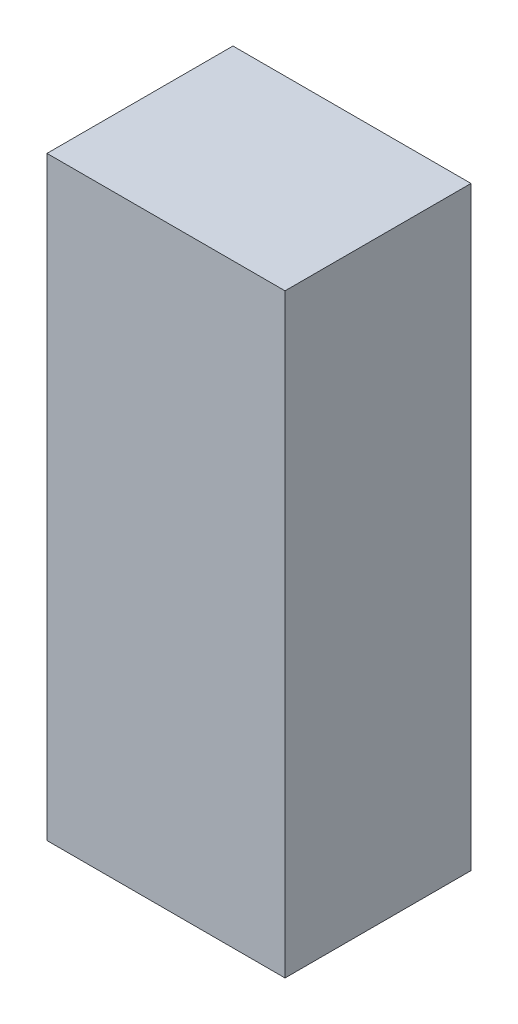
ISO-10303-21;
HEADER;
FILE_DESCRIPTION(('STEP AP214'),'2;1');
FILE_NAME('part.step','',(''),(''),'','','');
FILE_SCHEMA(('AUTOMOTIVE_DESIGN { 1 0 10303 214 1 1 1 1 }'));
ENDSEC;
DATA;
#1=APPLICATION_CONTEXT('core data for automotive mechanical design processes');
#2=APPLICATION_PROTOCOL_DEFINITION('international standard','automotive_design',2000,#1);
#3=PRODUCT_CONTEXT('',#1,'mechanical');
#4=PRODUCT('Part','Part','',(#3));
#5=PRODUCT_RELATED_PRODUCT_CATEGORY('part','',(#4));
#6=PRODUCT_DEFINITION_FORMATION('','',#4);
#7=PRODUCT_DEFINITION_CONTEXT('part definition',#1,'design');
#8=PRODUCT_DEFINITION('design','',#6,#7);
#9=PRODUCT_DEFINITION_SHAPE('','',#8);
#10=(LENGTH_UNIT() NAMED_UNIT(*) SI_UNIT(.MILLI.,.METRE.));
#11=(NAMED_UNIT(*) PLANE_ANGLE_UNIT() SI_UNIT($,.RADIAN.));
#12=(NAMED_UNIT(*) SI_UNIT($,.STERADIAN.) SOLID_ANGLE_UNIT());
#13=UNCERTAINTY_MEASURE_WITH_UNIT(LENGTH_MEASURE(1.E-05),#10,'distance_accuracy_value','');
#14=(GEOMETRIC_REPRESENTATION_CONTEXT(3) GLOBAL_UNCERTAINTY_ASSIGNED_CONTEXT((#13)) GLOBAL_UNIT_ASSIGNED_CONTEXT((#10,
#11,#12)) REPRESENTATION_CONTEXT('',''));
#15=CARTESIAN_POINT('',(0.,0.,0.));
#16=DIRECTION('',(0.,0.,1.));
#17=DIRECTION('',(1.,0.,0.));
#18=AXIS2_PLACEMENT_3D('',#15,#16,#17);
#19=CARTESIAN_POINT('',(-16.,40.,25.));
#20=DIRECTION('',(1.,0.,0.));
#21=DIRECTION('',(0.,0.,-1.));
#22=AXIS2_PLACEMENT_3D('',#19,#20,#21);
#23=PLANE('',#22);
#24=DIRECTION('',(0.,-1.,0.));
#25=VECTOR('',#24,1.);
#26=CARTESIAN_POINT('',(-16.,40.,0.));
#27=LINE('',#26,#25);
#28=CARTESIAN_POINT('',(-16.,40.,0.));
#29=VERTEX_POINT('',#28);
#30=CARTESIAN_POINT('',(-16.,-40.,0.));
#31=VERTEX_POINT('',#30);
#32=EDGE_CURVE('E107',#29,#31,#27,.T.);
#33=ORIENTED_EDGE('',*,*,#32,.T.);
#34=DIRECTION('',(0.,0.,-1.));
#35=VECTOR('',#34,1.);
#36=CARTESIAN_POINT('',(-16.,-40.,25.));
#37=LINE('',#36,#35);
#38=CARTESIAN_POINT('',(-16.,-40.,25.));
#39=VERTEX_POINT('',#38);
#40=EDGE_CURVE('E11',#39,#31,#37,.T.);
#41=ORIENTED_EDGE('',*,*,#40,.F.);
#42=DIRECTION('',(0.,-1.,0.));
#43=VECTOR('',#42,1.);
#44=CARTESIAN_POINT('',(-16.,40.,25.));
#45=LINE('',#44,#43);
#46=CARTESIAN_POINT('',(-16.,40.,25.));
#47=VERTEX_POINT('',#46);
#48=EDGE_CURVE('E91',#47,#39,#45,.T.);
#49=ORIENTED_EDGE('',*,*,#48,.F.);
#50=DIRECTION('',(0.,0.,-1.));
#51=VECTOR('',#50,1.);
#52=CARTESIAN_POINT('',(-16.,40.,25.));
#53=LINE('',#52,#51);
#54=EDGE_CURVE('E103',#47,#29,#53,.T.);
#55=ORIENTED_EDGE('',*,*,#54,.T.);
#56=EDGE_LOOP('',(#33,#41,#49,#55));
#57=FACE_BOUND('',#56,.T.);
#58=ADVANCED_FACE('F39',(#57),#23,.F.);
#59=CARTESIAN_POINT('',(-16.,-40.,25.));
#60=DIRECTION('',(0.,1.,0.));
#61=DIRECTION('',(-1.,0.,0.));
#62=AXIS2_PLACEMENT_3D('',#59,#60,#61);
#63=PLANE('',#62);
#64=DIRECTION('',(1.,0.,0.));
#65=VECTOR('',#64,1.);
#66=CARTESIAN_POINT('',(-16.,-40.,0.));
#67=LINE('',#66,#65);
#68=CARTESIAN_POINT('',(16.,-40.,0.));
#69=VERTEX_POINT('',#68);
#70=EDGE_CURVE('E96',#31,#69,#67,.T.);
#71=ORIENTED_EDGE('',*,*,#70,.T.);
#72=DIRECTION('',(0.,0.,-1.));
#73=VECTOR('',#72,1.);
#74=CARTESIAN_POINT('',(16.,-40.,25.));
#75=LINE('',#74,#73);
#76=CARTESIAN_POINT('',(16.,-40.,25.));
#77=VERTEX_POINT('',#76);
#78=EDGE_CURVE('E48',#77,#69,#75,.T.);
#79=ORIENTED_EDGE('',*,*,#78,.F.);
#80=DIRECTION('',(1.,0.,0.));
#81=VECTOR('',#80,1.);
#82=CARTESIAN_POINT('',(-16.,-40.,25.));
#83=LINE('',#82,#81);
#84=EDGE_CURVE('E86',#39,#77,#83,.T.);
#85=ORIENTED_EDGE('',*,*,#84,.F.);
#86=ORIENTED_EDGE('',*,*,#40,.T.);
#87=EDGE_LOOP('',(#71,#79,#85,#86));
#88=FACE_BOUND('',#87,.T.);
#89=ADVANCED_FACE('F95',(#88),#63,.F.);
#90=CARTESIAN_POINT('',(16.,40.,25.));
#91=DIRECTION('',(-1.,0.,0.));
#92=DIRECTION('',(0.,-1.,0.));
#93=AXIS2_PLACEMENT_3D('',#90,#91,#92);
#94=PLANE('',#93);
#95=DIRECTION('',(0.,1.,0.));
#96=VECTOR('',#95,1.);
#97=CARTESIAN_POINT('',(16.,40.,0.));
#98=LINE('',#97,#96);
#99=CARTESIAN_POINT('',(16.,40.,0.));
#100=VERTEX_POINT('',#99);
#101=EDGE_CURVE('E73',#69,#100,#98,.T.);
#102=ORIENTED_EDGE('',*,*,#101,.T.);
#103=DIRECTION('',(0.,0.,-1.));
#104=VECTOR('',#103,1.);
#105=CARTESIAN_POINT('',(16.,40.,25.));
#106=LINE('',#105,#104);
#107=CARTESIAN_POINT('',(16.,40.,25.));
#108=VERTEX_POINT('',#107);
#109=EDGE_CURVE('E98',#108,#100,#106,.T.);
#110=ORIENTED_EDGE('',*,*,#109,.F.);
#111=DIRECTION('',(0.,1.,0.));
#112=VECTOR('',#111,1.);
#113=CARTESIAN_POINT('',(16.,40.,25.));
#114=LINE('',#113,#112);
#115=EDGE_CURVE('E89',#77,#108,#114,.T.);
#116=ORIENTED_EDGE('',*,*,#115,.F.);
#117=ORIENTED_EDGE('',*,*,#78,.T.);
#118=EDGE_LOOP('',(#102,#110,#116,#117));
#119=FACE_BOUND('',#118,.T.);
#120=ADVANCED_FACE('F99',(#119),#94,.F.);
#121=CARTESIAN_POINT('',(-16.,40.,25.));
#122=DIRECTION('',(0.,-1.,0.));
#123=DIRECTION('',(1.,0.,0.));
#124=AXIS2_PLACEMENT_3D('',#121,#122,#123);
#125=PLANE('',#124);
#126=DIRECTION('',(-1.,0.,0.));
#127=VECTOR('',#126,1.);
#128=CARTESIAN_POINT('',(-16.,40.,0.));
#129=LINE('',#128,#127);
#130=EDGE_CURVE('E79',#100,#29,#129,.T.);
#131=ORIENTED_EDGE('',*,*,#130,.T.);
#132=ORIENTED_EDGE('',*,*,#54,.F.);
#133=DIRECTION('',(-1.,0.,0.));
#134=VECTOR('',#133,1.);
#135=CARTESIAN_POINT('',(-16.,40.,25.));
#136=LINE('',#135,#134);
#137=EDGE_CURVE('E56',#108,#47,#136,.T.);
#138=ORIENTED_EDGE('',*,*,#137,.F.);
#139=ORIENTED_EDGE('',*,*,#109,.T.);
#140=EDGE_LOOP('',(#131,#132,#138,#139));
#141=FACE_BOUND('',#140,.T.);
#142=ADVANCED_FACE('F120',(#141),#125,.F.);
#143=CARTESIAN_POINT('',(0.,0.,25.));
#144=DIRECTION('',(0.,0.,1.));
#145=DIRECTION('',(1.,0.,0.));
#146=AXIS2_PLACEMENT_3D('',#143,#144,#145);
#147=PLANE('',#146);
#148=ORIENTED_EDGE('',*,*,#48,.T.);
#149=ORIENTED_EDGE('',*,*,#84,.T.);
#150=ORIENTED_EDGE('',*,*,#115,.T.);
#151=ORIENTED_EDGE('',*,*,#137,.T.);
#152=EDGE_LOOP('',(#148,#149,#150,#151));
#153=FACE_BOUND('',#152,.T.);
#154=ADVANCED_FACE('F87',(#153),#147,.T.);
#155=CARTESIAN_POINT('',(0.,0.,0.));
#156=DIRECTION('',(0.,0.,1.));
#157=DIRECTION('',(1.,0.,0.));
#158=AXIS2_PLACEMENT_3D('',#155,#156,#157);
#159=PLANE('',#158);
#160=ORIENTED_EDGE('',*,*,#32,.F.);
#161=ORIENTED_EDGE('',*,*,#130,.F.);
#162=ORIENTED_EDGE('',*,*,#101,.F.);
#163=ORIENTED_EDGE('',*,*,#70,.F.);
#164=EDGE_LOOP('',(#160,#161,#162,#163));
#165=FACE_BOUND('',#164,.T.);
#166=ADVANCED_FACE('F123',(#165),#159,.F.);
#167=CLOSED_SHELL('',(#58,#89,#120,#142,#154,#166));
#168=MANIFOLD_SOLID_BREP('B2',#167);
#169=ADVANCED_BREP_SHAPE_REPRESENTATION('',(#18,#168),#14);
#170=SHAPE_DEFINITION_REPRESENTATION(#9,#169);
ENDSEC;
END-ISO-10303-21;
